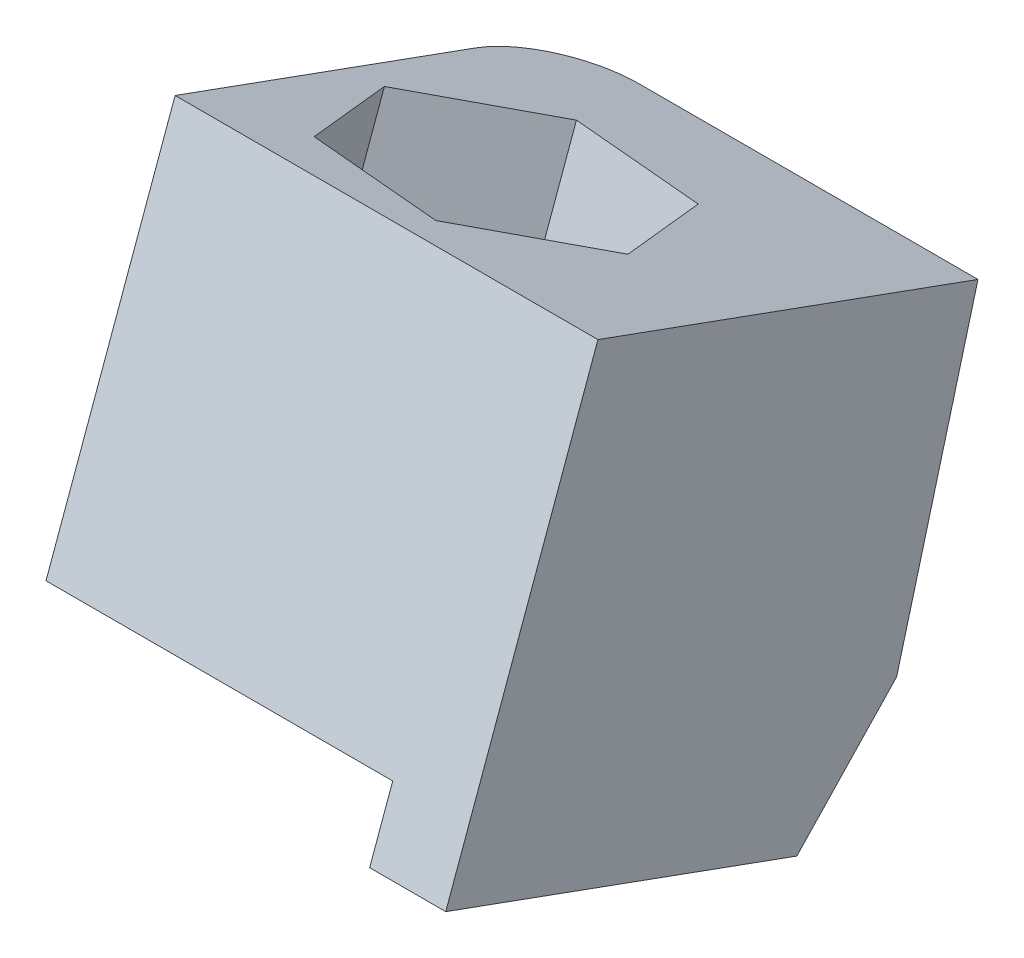
ISO-10303-21;
HEADER;
FILE_DESCRIPTION(('STEP AP214'),'2;1');
FILE_NAME('part.step','',(''),(''),'','','');
FILE_SCHEMA(('AUTOMOTIVE_DESIGN { 1 0 10303 214 1 1 1 1 }'));
ENDSEC;
DATA;
#1=APPLICATION_CONTEXT('core data for automotive mechanical design processes');
#2=APPLICATION_PROTOCOL_DEFINITION('international standard','automotive_design',2000,#1);
#3=PRODUCT_CONTEXT('',#1,'mechanical');
#4=PRODUCT('Part','Part','',(#3));
#5=PRODUCT_RELATED_PRODUCT_CATEGORY('part','',(#4));
#6=PRODUCT_DEFINITION_FORMATION('','',#4);
#7=PRODUCT_DEFINITION_CONTEXT('part definition',#1,'design');
#8=PRODUCT_DEFINITION('design','',#6,#7);
#9=PRODUCT_DEFINITION_SHAPE('','',#8);
#10=(LENGTH_UNIT() NAMED_UNIT(*) SI_UNIT(.MILLI.,.METRE.));
#11=(NAMED_UNIT(*) PLANE_ANGLE_UNIT() SI_UNIT($,.RADIAN.));
#12=(NAMED_UNIT(*) SI_UNIT($,.STERADIAN.) SOLID_ANGLE_UNIT());
#13=UNCERTAINTY_MEASURE_WITH_UNIT(LENGTH_MEASURE(1.E-05),#10,'distance_accuracy_value','');
#14=(GEOMETRIC_REPRESENTATION_CONTEXT(3) GLOBAL_UNCERTAINTY_ASSIGNED_CONTEXT((#13)) GLOBAL_UNIT_ASSIGNED_CONTEXT((#10,
#11,#12)) REPRESENTATION_CONTEXT('',''));
#15=CARTESIAN_POINT('',(0.,0.,0.));
#16=DIRECTION('',(0.,0.,1.));
#17=DIRECTION('',(1.,0.,0.));
#18=AXIS2_PLACEMENT_3D('',#15,#16,#17);
#19=CARTESIAN_POINT('',(0.,0.,0.));
#20=DIRECTION('',(-1.,0.,0.));
#21=DIRECTION('',(0.,0.,1.));
#22=AXIS2_PLACEMENT_3D('',#19,#20,#21);
#23=PLANE('',#22);
#24=DIRECTION('',(0.,0.341123131095332,0.940018621853693));
#25=VECTOR('',#24,1.);
#26=CARTESIAN_POINT('',(0.,171.265590649727,-97.4199582610171));
#27=LINE('',#26,#25);
#28=CARTESIAN_POINT('',(0.,168.688536046259,-104.521438917035));
#29=VERTEX_POINT('',#28);
#30=CARTESIAN_POINT('',(0.,171.265590649727,-97.4199582610171));
#31=VERTEX_POINT('',#30);
#32=EDGE_CURVE('E206',#29,#31,#27,.T.);
#33=ORIENTED_EDGE('',*,*,#32,.F.);
#34=DIRECTION('',(0.,0.965887749349842,-0.258961108384823));
#35=VECTOR('',#34,1.);
#36=CARTESIAN_POINT('',(0.,161.344698217693,-102.552505792907));
#37=LINE('',#36,#35);
#38=CARTESIAN_POINT('',(0.,160.011650268805,-102.195106525128));
#39=VERTEX_POINT('',#38);
#40=EDGE_CURVE('E54',#29,#39,#37,.F.);
#41=ORIENTED_EDGE('',*,*,#40,.T.);
#42=DIRECTION('',(0.,-0.341123131095332,-0.940018621853693));
#43=VECTOR('',#42,1.);
#44=CARTESIAN_POINT('',(0.,162.852423984136,-94.3669062377139));
#45=LINE('',#44,#43);
#46=CARTESIAN_POINT('',(0.,162.852423984136,-94.3669062377139));
#47=VERTEX_POINT('',#46);
#48=EDGE_CURVE('E139',#47,#39,#45,.T.);
#49=ORIENTED_EDGE('',*,*,#48,.F.);
#50=DIRECTION('',(0.,-0.940018621853693,0.341123131095332));
#51=VECTOR('',#50,1.);
#52=CARTESIAN_POINT('',(0.,171.265590649727,-97.4199582610171));
#53=LINE('',#52,#51);
#54=EDGE_CURVE('E155',#31,#47,#53,.T.);
#55=ORIENTED_EDGE('',*,*,#54,.F.);
#56=EDGE_LOOP('',(#33,#41,#49,#55));
#57=FACE_BOUND('',#56,.T.);
#58=ADVANCED_FACE('F32',(#57),#23,.T.);
#59=CARTESIAN_POINT('',(5.34740721586496,172.331144249481,-98.7343217056999));
#60=DIRECTION('',(-0.138711114408334,0.33782545518257,0.930931355455539));
#61=DIRECTION('',(0.,-0.940018621853693,0.341123131095333));
#62=AXIS2_PLACEMENT_3D('',#59,#60,#61);
#63=PLANE('',#62);
#64=DIRECTION('',(0.990332886831291,0.0473175696646939,0.130391030601912));
#65=VECTOR('',#64,1.);
#66=CARTESIAN_POINT('',(5.34740721586496,162.554950582203,-95.1866411423085));
#67=LINE('',#66,#65);
#68=CARTESIAN_POINT('',(2.03114725482848,162.39650147502,-95.6232726626925));
#69=VERTEX_POINT('',#68);
#70=CARTESIAN_POINT('',(5.34740721586496,162.554950582203,-95.1866411423085));
#71=VERTEX_POINT('',#70);
#72=EDGE_CURVE('E167',#69,#71,#67,.T.);
#73=ORIENTED_EDGE('',*,*,#72,.F.);
#74=DIRECTION('',(0.,-0.940018621853693,0.341123131095333));
#75=VECTOR('',#74,1.);
#76=CARTESIAN_POINT('',(2.03114725482848,172.172695142298,-99.1709532260839));
#77=LINE('',#76,#75);
#78=CARTESIAN_POINT('',(2.03114725482848,170.80966814061,-98.6763246859957));
#79=VERTEX_POINT('',#78);
#80=EDGE_CURVE('E170',#79,#69,#77,.T.);
#81=ORIENTED_EDGE('',*,*,#80,.F.);
#82=DIRECTION('',(-0.990332886831291,-0.0473175696646938,-0.130391030601912));
#83=VECTOR('',#82,1.);
#84=CARTESIAN_POINT('',(10.0302729632323,171.191862040254,-97.6231290798492));
#85=LINE('',#84,#83);
#86=CARTESIAN_POINT('',(5.34740721586496,170.968117247793,-98.2396931656117));
#87=VERTEX_POINT('',#86);
#88=EDGE_CURVE('E203',#87,#79,#85,.T.);
#89=ORIENTED_EDGE('',*,*,#88,.F.);
#90=DIRECTION('',(0.,-0.940018621853693,0.341123131095333));
#91=VECTOR('',#90,1.);
#92=CARTESIAN_POINT('',(5.34740721586496,172.331144249481,-98.7343217056999));
#93=LINE('',#92,#91);
#94=EDGE_CURVE('E171',#87,#71,#93,.T.);
#95=ORIENTED_EDGE('',*,*,#94,.T.);
#96=EDGE_LOOP('',(#73,#81,#89,#95));
#97=FACE_BOUND('',#96,.T.);
#98=ADVANCED_FACE('F272',(#97),#63,.F.);
#99=CARTESIAN_POINT('',(7.40779942816731,171.430674983043,-101.215706876329));
#100=DIRECTION('',(0.788297880994922,0.209890944966245,0.578387622654646));
#101=DIRECTION('',(0.591564845887052,0.,-0.806257423600322));
#102=AXIS2_PLACEMENT_3D('',#99,#100,#101);
#103=PLANE('',#102);
#104=DIRECTION('',(0.615293792280498,-0.268906641400803,-0.741014687703033));
#105=VECTOR('',#104,1.);
#106=CARTESIAN_POINT('',(7.40779942816732,161.654481315765,-97.6680263129376));
#107=LINE('',#106,#105);
#108=CARTESIAN_POINT('',(7.40779942816731,161.654481315765,-97.6680263129376));
#109=VERTEX_POINT('',#108);
#110=EDGE_CURVE('E165',#71,#109,#107,.T.);
#111=ORIENTED_EDGE('',*,*,#110,.F.);
#112=ORIENTED_EDGE('',*,*,#94,.F.);
#113=DIRECTION('',(-0.615293792280498,0.268906641400803,0.741014687703033));
#114=VECTOR('',#113,1.);
#115=CARTESIAN_POINT('',(6.68584551470969,170.383169126782,-99.8516100262584));
#116=LINE('',#115,#114);
#117=CARTESIAN_POINT('',(7.40779942816731,170.067647981355,-100.721078336241));
#118=VERTEX_POINT('',#117);
#119=EDGE_CURVE('E200',#118,#87,#116,.T.);
#120=ORIENTED_EDGE('',*,*,#119,.F.);
#121=DIRECTION('',(0.,-0.940018621853693,0.341123131095333));
#122=VECTOR('',#121,1.);
#123=CARTESIAN_POINT('',(7.40779942816731,171.430674983043,-101.215706876329));
#124=LINE('',#123,#122);
#125=EDGE_CURVE('E175',#118,#109,#124,.T.);
#126=ORIENTED_EDGE('',*,*,#125,.T.);
#127=EDGE_LOOP('',(#111,#112,#120,#126));
#128=FACE_BOUND('',#127,.T.);
#129=ADVANCED_FACE('F277',(#128),#103,.F.);
#130=CARTESIAN_POINT('',(6.15193167943325,170.371756609422,-104.133723567342));
#131=DIRECTION('',(0.927008995403243,-0.127934510216321,-0.352543732800881));
#132=DIRECTION('',(-0.355464722259819,0.,-0.934689697829579));
#133=AXIS2_PLACEMENT_3D('',#130,#131,#132);
#134=PLANE('',#133);
#135=DIRECTION('',(-0.37503909455078,-0.316224211065493,-0.871405718304934));
#136=VECTOR('',#135,1.);
#137=CARTESIAN_POINT('',(6.15193167943325,160.595562942144,-100.586043003951));
#138=LINE('',#137,#136);
#139=CARTESIAN_POINT('',(6.15193167943325,160.595562942144,-100.586043003951));
#140=VERTEX_POINT('',#139);
#141=EDGE_CURVE('E163',#109,#140,#138,.T.);
#142=ORIENTED_EDGE('',*,*,#141,.F.);
#143=ORIENTED_EDGE('',*,*,#125,.F.);
#144=DIRECTION('',(0.37503909455078,0.316224211065492,0.871405718304934));
#145=VECTOR('',#144,1.);
#146=CARTESIAN_POINT('',(8.99331843252483,171.404520599616,-97.037114858958));
#147=LINE('',#146,#145);
#148=CARTESIAN_POINT('',(6.15193167943325,169.008729607734,-103.639095027254));
#149=VERTEX_POINT('',#148);
#150=EDGE_CURVE('E197',#149,#118,#147,.T.);
#151=ORIENTED_EDGE('',*,*,#150,.F.);
#152=DIRECTION('',(0.,-0.940018621853693,0.341123131095333));
#153=VECTOR('',#152,1.);
#154=CARTESIAN_POINT('',(6.15193167943325,170.371756609422,-104.133723567342));
#155=LINE('',#154,#153);
#156=EDGE_CURVE('E178',#149,#140,#155,.T.);
#157=ORIENTED_EDGE('',*,*,#156,.T.);
#158=EDGE_LOOP('',(#142,#143,#151,#157));
#159=FACE_BOUND('',#158,.T.);
#160=ADVANCED_FACE('F298',(#159),#134,.F.);
#161=CARTESIAN_POINT('',(2.83567171839683,170.213307502239,-104.570355087726));
#162=DIRECTION('',(0.138711114408337,-0.33782545518257,-0.930931355455539));
#163=DIRECTION('',(0.,0.940018621853693,-0.341123131095333));
#164=AXIS2_PLACEMENT_3D('',#161,#162,#163);
#165=PLANE('',#164);
#166=DIRECTION('',(-0.99033288683129,-0.0473175696646948,-0.130391030601915));
#167=VECTOR('',#166,1.);
#168=CARTESIAN_POINT('',(2.83567171839683,160.437113834961,-101.022674524335));
#169=LINE('',#168,#167);
#170=CARTESIAN_POINT('',(2.83567171839683,160.437113834961,-101.022674524335));
#171=VERTEX_POINT('',#170);
#172=EDGE_CURVE('E161',#140,#171,#169,.T.);
#173=ORIENTED_EDGE('',*,*,#172,.F.);
#174=ORIENTED_EDGE('',*,*,#156,.F.);
#175=DIRECTION('',(0.99033288683129,0.0473175696646947,0.130391030601915));
#176=VECTOR('',#175,1.);
#177=CARTESIAN_POINT('',(10.8347974268006,169.232474400195,-103.022530941491));
#178=LINE('',#177,#176);
#179=CARTESIAN_POINT('',(2.83567171839683,168.850280500551,-104.075726547638));
#180=VERTEX_POINT('',#179);
#181=EDGE_CURVE('E194',#180,#149,#178,.T.);
#182=ORIENTED_EDGE('',*,*,#181,.F.);
#183=DIRECTION('',(0.,-0.940018621853693,0.341123131095333));
#184=VECTOR('',#183,1.);
#185=CARTESIAN_POINT('',(2.83567171839683,170.213307502239,-104.570355087726));
#186=LINE('',#185,#184);
#187=EDGE_CURVE('E181',#180,#171,#186,.T.);
#188=ORIENTED_EDGE('',*,*,#187,.T.);
#189=EDGE_LOOP('',(#173,#174,#182,#188));
#190=FACE_BOUND('',#189,.T.);
#191=ADVANCED_FACE('F302',(#190),#165,.F.);
#192=CARTESIAN_POINT('',(0.775279506094418,171.113776768677,-102.088969917097));
#193=DIRECTION('',(-0.788297880994913,-0.209890944966249,-0.578387622654656));
#194=DIRECTION('',(-0.591564845887063,0.,0.806257423600314));
#195=AXIS2_PLACEMENT_3D('',#192,#193,#194);
#196=PLANE('',#195);
#197=DIRECTION('',(-0.615293792280509,0.2689066414008,0.741014687703025));
#198=VECTOR('',#197,1.);
#199=CARTESIAN_POINT('',(0.775279506094421,161.337583101399,-98.5412893537055));
#200=LINE('',#199,#198);
#201=CARTESIAN_POINT('',(0.775279506094418,161.337583101399,-98.5412893537055));
#202=VERTEX_POINT('',#201);
#203=EDGE_CURVE('E149',#171,#202,#200,.T.);
#204=ORIENTED_EDGE('',*,*,#203,.F.);
#205=ORIENTED_EDGE('',*,*,#187,.F.);
#206=DIRECTION('',(0.615293792280509,-0.2689066414008,-0.741014687703025));
#207=VECTOR('',#206,1.);
#208=CARTESIAN_POINT('',(2.1137178049392,169.165801645977,-103.206258237656));
#209=LINE('',#208,#207);
#210=CARTESIAN_POINT('',(0.775279506094418,169.750749766989,-101.594341377009));
#211=VERTEX_POINT('',#210);
#212=EDGE_CURVE('E191',#211,#180,#209,.T.);
#213=ORIENTED_EDGE('',*,*,#212,.F.);
#214=DIRECTION('',(0.,-0.940018621853693,0.341123131095333));
#215=VECTOR('',#214,1.);
#216=CARTESIAN_POINT('',(0.775279506094418,171.113776768677,-102.088969917097));
#217=LINE('',#216,#215);
#218=EDGE_CURVE('E184',#211,#202,#217,.T.);
#219=ORIENTED_EDGE('',*,*,#218,.T.);
#220=EDGE_LOOP('',(#204,#205,#213,#219));
#221=FACE_BOUND('',#220,.T.);
#222=ADVANCED_FACE('F306',(#221),#196,.F.);
#223=CARTESIAN_POINT('',(2.03114725482848,172.172695142298,-99.1709532260839));
#224=DIRECTION('',(-0.927008995403244,0.127934510216321,0.352543732800881));
#225=DIRECTION('',(0.355464722259818,0.,0.934689697829579));
#226=AXIS2_PLACEMENT_3D('',#223,#224,#225);
#227=PLANE('',#226);
#228=DIRECTION('',(0.37503909455078,0.316224211065493,0.871405718304934));
#229=VECTOR('',#228,1.);
#230=CARTESIAN_POINT('',(2.03114725482847,162.39650147502,-95.6232726626925));
#231=LINE('',#230,#229);
#232=EDGE_CURVE('E233',#202,#69,#231,.T.);
#233=ORIENTED_EDGE('',*,*,#232,.F.);
#234=ORIENTED_EDGE('',*,*,#218,.F.);
#235=DIRECTION('',(-0.37503909455078,-0.316224211065493,-0.871405718304934));
#236=VECTOR('',#235,1.);
#237=CARTESIAN_POINT('',(3.61666625918597,172.146540758871,-94.9923612087129));
#238=LINE('',#237,#236);
#239=EDGE_CURVE('E174',#79,#211,#238,.T.);
#240=ORIENTED_EDGE('',*,*,#239,.F.);
#241=ORIENTED_EDGE('',*,*,#80,.T.);
#242=EDGE_LOOP('',(#233,#234,#240,#241));
#243=FACE_BOUND('',#242,.T.);
#244=ADVANCED_FACE('F310',(#243),#227,.F.);
#245=CARTESIAN_POINT('',(10.,171.265590649727,-97.4199582610171));
#246=DIRECTION('',(0.,-0.940018621853693,0.341123131095332));
#247=DIRECTION('',(0.,-0.341123131095332,-0.940018621853693));
#248=AXIS2_PLACEMENT_3D('',#245,#246,#247);
#249=PLANE('',#248);
#250=ORIENTED_EDGE('',*,*,#119,.T.);
#251=ORIENTED_EDGE('',*,*,#88,.T.);
#252=ORIENTED_EDGE('',*,*,#239,.T.);
#253=ORIENTED_EDGE('',*,*,#212,.T.);
#254=ORIENTED_EDGE('',*,*,#181,.T.);
#255=ORIENTED_EDGE('',*,*,#150,.T.);
#256=EDGE_LOOP('',(#250,#251,#252,#253,#254,#255));
#257=FACE_BOUND('',#256,.T.);
#258=DIRECTION('',(-1.,0.,0.));
#259=VECTOR('',#258,1.);
#260=CARTESIAN_POINT('',(10.,168.00374929035,-106.408476892109));
#261=LINE('',#260,#259);
#262=CARTESIAN_POINT('',(10.,168.00374929035,-106.408476892109));
#263=VERTEX_POINT('',#262);
#264=CARTESIAN_POINT('',(2.,168.00374929035,-106.408476892109));
#265=VERTEX_POINT('',#264);
#266=EDGE_CURVE('E218',#263,#265,#261,.T.);
#267=ORIENTED_EDGE('',*,*,#266,.T.);
#268=CARTESIAN_POINT('',(2.,168.688536046259,-104.521438917035));
#269=DIRECTION('',(0.,-0.940018621853693,0.341123131095332));
#270=DIRECTION('',(0.,-0.341123131095332,-0.940018621853693));
#271=AXIS2_PLACEMENT_3D('',#268,#269,#270);
#272=ELLIPSE('',#271,2.00744743902357,2.);
#273=EDGE_CURVE('E240',#265,#29,#272,.F.);
#274=ORIENTED_EDGE('',*,*,#273,.T.);
#275=ORIENTED_EDGE('',*,*,#32,.T.);
#276=DIRECTION('',(-1.,0.,0.));
#277=VECTOR('',#276,1.);
#278=CARTESIAN_POINT('',(10.,171.265590649727,-97.4199582610171));
#279=LINE('',#278,#277);
#280=CARTESIAN_POINT('',(10.,171.265590649727,-97.4199582610171));
#281=VERTEX_POINT('',#280);
#282=EDGE_CURVE('E231',#281,#31,#279,.T.);
#283=ORIENTED_EDGE('',*,*,#282,.F.);
#284=DIRECTION('',(0.,0.341123131095332,0.940018621853693));
#285=VECTOR('',#284,1.);
#286=CARTESIAN_POINT('',(10.,171.265590649727,-97.4199582610171));
#287=LINE('',#286,#285);
#288=EDGE_CURVE('E207',#263,#281,#287,.T.);
#289=ORIENTED_EDGE('',*,*,#288,.F.);
#290=EDGE_LOOP('',(#267,#274,#275,#283,#289));
#291=FACE_BOUND('',#290,.T.);
#292=ADVANCED_FACE('F243',(#257,#291),#249,.F.);
#293=CARTESIAN_POINT('',(10.,171.265590649727,-97.4199582610171));
#294=DIRECTION('',(0.,-0.341123131095332,-0.940018621853693));
#295=DIRECTION('',(0.,0.940018621853693,-0.341123131095332));
#296=AXIS2_PLACEMENT_3D('',#293,#294,#295);
#297=PLANE('',#296);
#298=DIRECTION('',(-1.,0.,0.));
#299=VECTOR('',#298,1.);
#300=CARTESIAN_POINT('',(0.,162.852423984136,-94.3669062377139));
#301=LINE('',#300,#299);
#302=CARTESIAN_POINT('',(8.2,162.852423984136,-94.3669062377139));
#303=VERTEX_POINT('',#302);
#304=EDGE_CURVE('E135',#303,#47,#301,.T.);
#305=ORIENTED_EDGE('',*,*,#304,.F.);
#306=DIRECTION('',(0.,-0.940018621853693,0.341123131095332));
#307=VECTOR('',#306,1.);
#308=CARTESIAN_POINT('',(8.2,162.852423984136,-94.3669062377139));
#309=LINE('',#308,#307);
#310=CARTESIAN_POINT('',(8.2,161.34839418917,-93.8211092279614));
#311=VERTEX_POINT('',#310);
#312=EDGE_CURVE('E142',#303,#311,#309,.T.);
#313=ORIENTED_EDGE('',*,*,#312,.T.);
#314=DIRECTION('',(-1.,0.,0.));
#315=VECTOR('',#314,1.);
#316=CARTESIAN_POINT('',(10.,161.34839418917,-93.8211092279614));
#317=LINE('',#316,#315);
#318=CARTESIAN_POINT('',(10.,161.34839418917,-93.8211092279614));
#319=VERTEX_POINT('',#318);
#320=EDGE_CURVE('E229',#319,#311,#317,.T.);
#321=ORIENTED_EDGE('',*,*,#320,.F.);
#322=DIRECTION('',(0.,-0.940018621853693,0.341123131095332));
#323=VECTOR('',#322,1.);
#324=CARTESIAN_POINT('',(10.,171.265590649727,-97.4199582610171));
#325=LINE('',#324,#323);
#326=EDGE_CURVE('E210',#281,#319,#325,.T.);
#327=ORIENTED_EDGE('',*,*,#326,.F.);
#328=ORIENTED_EDGE('',*,*,#282,.T.);
#329=ORIENTED_EDGE('',*,*,#54,.T.);
#330=EDGE_LOOP('',(#305,#313,#321,#327,#328,#329));
#331=FACE_BOUND('',#330,.T.);
#332=ADVANCED_FACE('F152',(#331),#297,.F.);
#333=CARTESIAN_POINT('',(10.,158.335097963573,-102.124722518938));
#334=DIRECTION('',(0.,0.940018621853693,-0.341123131095332));
#335=DIRECTION('',(0.,0.341123131095332,0.940018621853693));
#336=AXIS2_PLACEMENT_3D('',#333,#334,#335);
#337=PLANE('',#336);
#338=ORIENTED_EDGE('',*,*,#320,.T.);
#339=DIRECTION('',(0.,0.341123131095333,0.940018621853693));
#340=VECTOR('',#339,1.);
#341=CARTESIAN_POINT('',(8.2,161.34839418917,-93.8211092279614));
#342=LINE('',#341,#340);
#343=CARTESIAN_POINT('',(8.2,158.335097963573,-102.124722518938));
#344=VERTEX_POINT('',#343);
#345=EDGE_CURVE('E145',#344,#311,#342,.T.);
#346=ORIENTED_EDGE('',*,*,#345,.F.);
#347=DIRECTION('',(-1.,0.,0.));
#348=VECTOR('',#347,1.);
#349=CARTESIAN_POINT('',(10.,158.335097963573,-102.124722518938));
#350=LINE('',#349,#348);
#351=CARTESIAN_POINT('',(10.,158.335097963573,-102.124722518938));
#352=VERTEX_POINT('',#351);
#353=EDGE_CURVE('E226',#352,#344,#350,.T.);
#354=ORIENTED_EDGE('',*,*,#353,.F.);
#355=DIRECTION('',(0.,-0.341123131095332,-0.940018621853693));
#356=VECTOR('',#355,1.);
#357=CARTESIAN_POINT('',(10.,158.335097963573,-102.124722518938));
#358=LINE('',#357,#356);
#359=EDGE_CURVE('E212',#319,#352,#358,.T.);
#360=ORIENTED_EDGE('',*,*,#359,.F.);
#361=EDGE_LOOP('',(#338,#346,#354,#360));
#362=FACE_BOUND('',#361,.T.);
#363=ADVANCED_FACE('F262',(#362),#337,.F.);
#364=CARTESIAN_POINT('',(10.,158.335097963573,-102.124722518938));
#365=DIRECTION('',(0.,0.687594389221847,0.726095004741552));
#366=DIRECTION('',(0.,-0.726095004741552,0.687594389221847));
#367=AXIS2_PLACEMENT_3D('',#364,#365,#366);
#368=PLANE('',#367);
#369=DIRECTION('',(1.,0.,0.));
#370=VECTOR('',#369,1.);
#371=CARTESIAN_POINT('',(10.,159.601868854537,-103.324323881525));
#372=LINE('',#371,#370);
#373=CARTESIAN_POINT('',(0.397615942011993,159.601868854537,-103.324323881525));
#374=VERTEX_POINT('',#373);
#375=CARTESIAN_POINT('',(8.2,159.601868854537,-103.324323881525));
#376=VERTEX_POINT('',#375);
#377=EDGE_CURVE('E136',#374,#376,#372,.T.);
#378=ORIENTED_EDGE('',*,*,#377,.F.);
#379=CARTESIAN_POINT('',(2.,157.776652734014,-101.595888407665));
#380=DIRECTION('',(0.,0.687594389221847,0.726095004741552));
#381=DIRECTION('',(0.,-0.726095004741552,0.687594389221847));
#382=AXIS2_PLACEMENT_3D('',#379,#380,#381);
#383=ELLIPSE('',#382,4.2007220088154,2.);
#384=CARTESIAN_POINT('',(2.,160.826776000923,-104.484281291607));
#385=VERTEX_POINT('',#384);
#386=EDGE_CURVE('E11',#374,#385,#383,.F.);
#387=ORIENTED_EDGE('',*,*,#386,.T.);
#388=DIRECTION('',(-1.,0.,0.));
#389=VECTOR('',#388,1.);
#390=CARTESIAN_POINT('',(10.,160.826776000923,-104.484281291607));
#391=LINE('',#390,#389);
#392=CARTESIAN_POINT('',(10.,160.826776000923,-104.484281291607));
#393=VERTEX_POINT('',#392);
#394=EDGE_CURVE('E223',#393,#385,#391,.T.);
#395=ORIENTED_EDGE('',*,*,#394,.F.);
#396=DIRECTION('',(0.,0.726095004741552,-0.687594389221847));
#397=VECTOR('',#396,1.);
#398=CARTESIAN_POINT('',(10.,158.335097963573,-102.124722518938));
#399=LINE('',#398,#397);
#400=EDGE_CURVE('E214',#352,#393,#399,.T.);
#401=ORIENTED_EDGE('',*,*,#400,.F.);
#402=ORIENTED_EDGE('',*,*,#353,.T.);
#403=DIRECTION('',(0.,0.726095004741552,-0.687594389221847));
#404=VECTOR('',#403,1.);
#405=CARTESIAN_POINT('',(8.2,158.335097963573,-102.124722518938));
#406=LINE('',#405,#404);
#407=EDGE_CURVE('E235',#344,#376,#406,.T.);
#408=ORIENTED_EDGE('',*,*,#407,.T.);
#409=EDGE_LOOP('',(#378,#387,#395,#401,#402,#408));
#410=FACE_BOUND('',#409,.T.);
#411=ADVANCED_FACE('F252',(#410),#368,.F.);
#412=CARTESIAN_POINT('',(10.,168.00374929035,-106.408476892109));
#413=DIRECTION('',(0.,0.258961108384823,0.965887749349843));
#414=DIRECTION('',(0.,-0.965887749349842,0.258961108384823));
#415=AXIS2_PLACEMENT_3D('',#412,#413,#414);
#416=PLANE('',#415);
#417=ORIENTED_EDGE('',*,*,#394,.T.);
#418=DIRECTION('',(0.,0.965887749349842,-0.258961108384823));
#419=VECTOR('',#418,1.);
#420=CARTESIAN_POINT('',(2.,168.00374929035,-106.408476892109));
#421=LINE('',#420,#419);
#422=EDGE_CURVE('E237',#385,#265,#421,.T.);
#423=ORIENTED_EDGE('',*,*,#422,.T.);
#424=ORIENTED_EDGE('',*,*,#266,.F.);
#425=DIRECTION('',(0.,0.965887749349843,-0.258961108384823));
#426=VECTOR('',#425,1.);
#427=CARTESIAN_POINT('',(10.,168.00374929035,-106.408476892109));
#428=LINE('',#427,#426);
#429=EDGE_CURVE('E216',#393,#263,#428,.T.);
#430=ORIENTED_EDGE('',*,*,#429,.F.);
#431=EDGE_LOOP('',(#417,#423,#424,#430));
#432=FACE_BOUND('',#431,.T.);
#433=ADVANCED_FACE('F256',(#432),#416,.F.);
#434=CARTESIAN_POINT('',(10.,0.,0.));
#435=DIRECTION('',(-1.,0.,0.));
#436=DIRECTION('',(0.,0.,1.));
#437=AXIS2_PLACEMENT_3D('',#434,#435,#436);
#438=PLANE('',#437);
#439=ORIENTED_EDGE('',*,*,#288,.T.);
#440=ORIENTED_EDGE('',*,*,#326,.T.);
#441=ORIENTED_EDGE('',*,*,#359,.T.);
#442=ORIENTED_EDGE('',*,*,#400,.T.);
#443=ORIENTED_EDGE('',*,*,#429,.T.);
#444=EDGE_LOOP('',(#439,#440,#441,#442,#443));
#445=FACE_BOUND('',#444,.T.);
#446=ADVANCED_FACE('F258',(#445),#438,.F.);
#447=CARTESIAN_POINT('',(8.2,162.852423984136,-94.3669062377139));
#448=DIRECTION('',(1.,0.,0.));
#449=DIRECTION('',(0.,0.,-1.));
#450=AXIS2_PLACEMENT_3D('',#447,#448,#449);
#451=PLANE('',#450);
#452=ORIENTED_EDGE('',*,*,#345,.T.);
#453=ORIENTED_EDGE('',*,*,#312,.F.);
#454=DIRECTION('',(0.,0.34112313109533,0.940018621853694));
#455=VECTOR('',#454,1.);
#456=CARTESIAN_POINT('',(8.2,159.585298821167,-103.369985223463));
#457=LINE('',#456,#455);
#458=EDGE_CURVE('E131',#376,#303,#457,.T.);
#459=ORIENTED_EDGE('',*,*,#458,.F.);
#460=ORIENTED_EDGE('',*,*,#407,.F.);
#461=EDGE_LOOP('',(#452,#453,#459,#460));
#462=FACE_BOUND('',#461,.T.);
#463=ADVANCED_FACE('F143',(#462),#451,.F.);
#464=CARTESIAN_POINT('',(0.,174.161993110282,-63.2016036984743));
#465=DIRECTION('',(0.,-0.940018621853693,0.341123131095332));
#466=DIRECTION('',(0.,-0.341123131095332,-0.940018621853693));
#467=AXIS2_PLACEMENT_3D('',#464,#465,#466);
#468=PLANE('',#467);
#469=ORIENTED_EDGE('',*,*,#72,.T.);
#470=ORIENTED_EDGE('',*,*,#110,.T.);
#471=ORIENTED_EDGE('',*,*,#141,.T.);
#472=ORIENTED_EDGE('',*,*,#172,.T.);
#473=ORIENTED_EDGE('',*,*,#203,.T.);
#474=ORIENTED_EDGE('',*,*,#232,.T.);
#475=EDGE_LOOP('',(#469,#470,#471,#472,#473,#474));
#476=FACE_BOUND('',#475,.T.);
#477=ORIENTED_EDGE('',*,*,#48,.T.);
#478=CARTESIAN_POINT('',(2.,160.011650268805,-102.195106525128));
#479=DIRECTION('',(0.,-0.940018621853693,0.341123131095332));
#480=DIRECTION('',(0.,-0.341123131095332,-0.940018621853693));
#481=AXIS2_PLACEMENT_3D('',#478,#479,#480);
#482=ELLIPSE('',#481,2.00744743902357,2.);
#483=EDGE_CURVE('E40',#39,#374,#482,.T.);
#484=ORIENTED_EDGE('',*,*,#483,.T.);
#485=ORIENTED_EDGE('',*,*,#377,.T.);
#486=ORIENTED_EDGE('',*,*,#458,.T.);
#487=ORIENTED_EDGE('',*,*,#304,.T.);
#488=EDGE_LOOP('',(#477,#484,#485,#486,#487));
#489=FACE_BOUND('',#488,.T.);
#490=ADVANCED_FACE('F133',(#476,#489),#468,.T.);
#491=CARTESIAN_POINT('',(2.,168.521671507119,-104.476701393409));
#492=DIRECTION('',(0.,-0.965887749349842,0.258961108384823));
#493=DIRECTION('',(0.,-0.258961108384823,-0.965887749349843));
#494=AXIS2_PLACEMENT_3D('',#491,#492,#493);
#495=CYLINDRICAL_SURFACE('',#494,2.);
#496=ORIENTED_EDGE('',*,*,#483,.F.);
#497=ORIENTED_EDGE('',*,*,#40,.F.);
#498=ORIENTED_EDGE('',*,*,#273,.F.);
#499=ORIENTED_EDGE('',*,*,#422,.F.);
#500=ORIENTED_EDGE('',*,*,#386,.F.);
#501=EDGE_LOOP('',(#496,#497,#498,#499,#500));
#502=FACE_BOUND('',#501,.T.);
#503=ADVANCED_FACE('F34',(#502),#495,.T.);
#504=CLOSED_SHELL('',(#58,#98,#129,#160,#191,#222,#244,#292,#332,#363,#411,#433,#446,#463,#490,#503));
#505=MANIFOLD_SOLID_BREP('B2',#504);
#506=ADVANCED_BREP_SHAPE_REPRESENTATION('',(#18,#505),#14);
#507=SHAPE_DEFINITION_REPRESENTATION(#9,#506);
ENDSEC;
END-ISO-10303-21;
